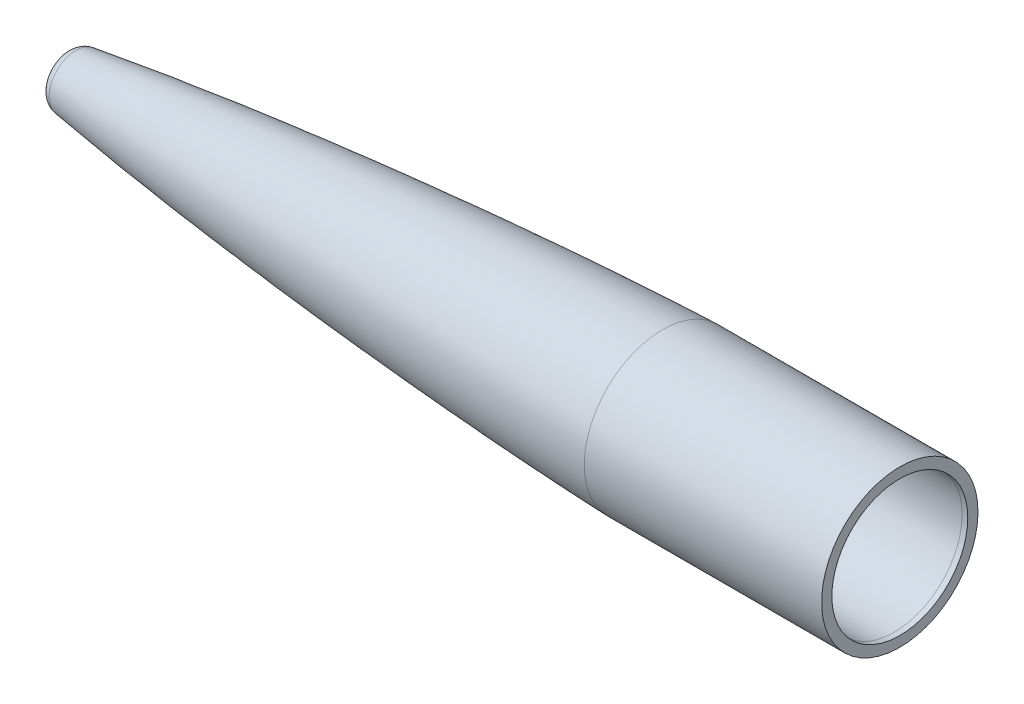
ISO-10303-21;
HEADER;
FILE_DESCRIPTION(('STEP AP214'),'2;1');
FILE_NAME('part.step','',(''),(''),'','','');
FILE_SCHEMA(('AUTOMOTIVE_DESIGN { 1 0 10303 214 1 1 1 1 }'));
ENDSEC;
DATA;
#1=APPLICATION_CONTEXT('core data for automotive mechanical design processes');
#2=APPLICATION_PROTOCOL_DEFINITION('international standard','automotive_design',2000,#1);
#3=PRODUCT_CONTEXT('',#1,'mechanical');
#4=PRODUCT('Part','Part','',(#3));
#5=PRODUCT_RELATED_PRODUCT_CATEGORY('part','',(#4));
#6=PRODUCT_DEFINITION_FORMATION('','',#4);
#7=PRODUCT_DEFINITION_CONTEXT('part definition',#1,'design');
#8=PRODUCT_DEFINITION('design','',#6,#7);
#9=PRODUCT_DEFINITION_SHAPE('','',#8);
#10=(LENGTH_UNIT() NAMED_UNIT(*) SI_UNIT(.MILLI.,.METRE.));
#11=(NAMED_UNIT(*) PLANE_ANGLE_UNIT() SI_UNIT($,.RADIAN.));
#12=(NAMED_UNIT(*) SI_UNIT($,.STERADIAN.) SOLID_ANGLE_UNIT());
#13=UNCERTAINTY_MEASURE_WITH_UNIT(LENGTH_MEASURE(1.E-05),#10,'distance_accuracy_value','');
#14=(GEOMETRIC_REPRESENTATION_CONTEXT(3) GLOBAL_UNCERTAINTY_ASSIGNED_CONTEXT((#13)) GLOBAL_UNIT_ASSIGNED_CONTEXT((#10,
#11,#12)) REPRESENTATION_CONTEXT('',''));
#15=CARTESIAN_POINT('',(0.,0.,0.));
#16=DIRECTION('',(0.,0.,1.));
#17=DIRECTION('',(1.,0.,0.));
#18=AXIS2_PLACEMENT_3D('',#15,#16,#17);
#19=CARTESIAN_POINT('',(0.,-76.2,0.));
#20=DIRECTION('',(1.,0.,0.));
#21=DIRECTION('',(0.,0.,-1.));
#22=AXIS2_PLACEMENT_3D('',#19,#20,#21);
#23=CYLINDRICAL_SURFACE('',#22,87.6605702842971);
#24=CARTESIAN_POINT('',(6.35000000000027,-76.2,0.));
#25=DIRECTION('',(1.,0.,0.));
#26=DIRECTION('',(0.,0.,-1.));
#27=AXIS2_PLACEMENT_3D('',#24,#25,#26);
#28=CIRCLE('',#27,87.6605702842971);
#29=CARTESIAN_POINT('',(6.35000000000027,-76.2,-87.6605702842971));
#30=VERTEX_POINT('',#29);
#31=EDGE_CURVE('E68',#30,#30,#28,.T.);
#32=ORIENTED_EDGE('',*,*,#31,.F.);
#33=EDGE_LOOP('',(#32));
#34=FACE_BOUND('',#33,.T.);
#35=CARTESIAN_POINT('',(-259.812483714893,-76.2,0.));
#36=DIRECTION('',(1.,0.,0.));
#37=DIRECTION('',(0.,0.,-1.));
#38=AXIS2_PLACEMENT_3D('',#35,#36,#37);
#39=CIRCLE('',#38,87.6605702842971);
#40=CARTESIAN_POINT('',(-259.812483714893,-76.2,-87.6605702842971));
#41=VERTEX_POINT('',#40);
#42=EDGE_CURVE('E10',#41,#41,#39,.T.);
#43=ORIENTED_EDGE('',*,*,#42,.T.);
#44=EDGE_LOOP('',(#43));
#45=FACE_BOUND('',#44,.T.);
#46=ADVANCED_FACE('F31',(#34,#45),#23,.T.);
#47=CARTESIAN_POINT('',(-259.812483714893,11.460570284297,0.));
#48=CARTESIAN_POINT('',(-287.312106379697,10.5623408515305,0.));
#49=CARTESIAN_POINT('',(-342.298022137353,8.17156900853598,0.));
#50=CARTESIAN_POINT('',(-452.140135715747,1.83352473554385,0.));
#51=CARTESIAN_POINT('',(-589.280273051557,-8.5121188078909,0.));
#52=CARTESIAN_POINT('',(-726.176632388446,-21.7709007537404,0.));
#53=CARTESIAN_POINT('',(-835.465785428388,-34.5887261399924,0.));
#54=CARTESIAN_POINT('',(-890.027026606975,-41.9652027624198,0.));
#55=CARTESIAN_POINT('',(-917.245364412614,-46.0396236215406,0.));
#56=B_SPLINE_CURVE_WITH_KNOTS('',3,(#47,#48,#49,#50,#51,#52,#53,#54,#55),.UNSPECIFIED.,.F.,.F.,
(4,1,1,1,1,1,4),(0.121539177885851,0.200323508121493,0.279107838357135,0.436676498828419,
0.594245159299703,0.673029489535345,0.751813819770986),.UNSPECIFIED.);
#57=CARTESIAN_POINT('',(0.,-76.2,0.));
#58=DIRECTION('',(1.,0.,0.));
#59=AXIS1_PLACEMENT('',#57,#58);
#60=SURFACE_OF_REVOLUTION('',#56,#59);
#61=CARTESIAN_POINT('',(-917.245364412614,-76.2,0.));
#62=DIRECTION('',(1.,0.,0.));
#63=DIRECTION('',(0.,0.,-1.));
#64=AXIS2_PLACEMENT_3D('',#61,#62,#63);
#65=CIRCLE('',#64,30.1603763784594);
#66=CARTESIAN_POINT('',(-917.245364412614,-76.2,-30.1603763784594));
#67=VERTEX_POINT('',#66);
#68=EDGE_CURVE('E37',#67,#67,#65,.T.);
#69=ORIENTED_EDGE('',*,*,#68,.T.);
#70=EDGE_LOOP('',(#69));
#71=FACE_BOUND('',#70,.T.);
#72=ORIENTED_EDGE('',*,*,#42,.F.);
#73=EDGE_LOOP('',(#72));
#74=FACE_BOUND('',#73,.T.);
#75=ADVANCED_FACE('F112',(#71,#74),#60,.F.);
#76=CARTESIAN_POINT('',(-915.3652,-76.2,0.));
#77=DIRECTION('',(1.,0.,0.));
#78=DIRECTION('',(0.,0.,-1.));
#79=AXIS2_PLACEMENT_3D('',#76,#77,#78);
#80=TOROIDAL_SURFACE('',#79,17.6003213713529,12.7);
#81=CARTESIAN_POINT('',(-928.0652,-76.2,0.));
#82=DIRECTION('',(1.,0.,0.));
#83=DIRECTION('',(0.,0.,-1.));
#84=AXIS2_PLACEMENT_3D('',#81,#82,#83);
#85=CIRCLE('',#84,17.6003213713529);
#86=CARTESIAN_POINT('',(-928.0652,-76.2,-17.6003213713529));
#87=VERTEX_POINT('',#86);
#88=EDGE_CURVE('E41',#87,#87,#85,.T.);
#89=ORIENTED_EDGE('',*,*,#88,.T.);
#90=EDGE_LOOP('',(#89));
#91=FACE_BOUND('',#90,.T.);
#92=ORIENTED_EDGE('',*,*,#68,.F.);
#93=EDGE_LOOP('',(#92));
#94=FACE_BOUND('',#93,.T.);
#95=ADVANCED_FACE('F109',(#91,#94),#80,.T.);
#96=CARTESIAN_POINT('',(0.,-76.2,0.));
#97=DIRECTION('',(1.,0.,0.));
#98=DIRECTION('',(0.,0.,-1.));
#99=AXIS2_PLACEMENT_3D('',#96,#97,#98);
#100=CYLINDRICAL_SURFACE('',#99,17.6003213713529);
#101=ORIENTED_EDGE('',*,*,#88,.F.);
#102=EDGE_LOOP('',(#101));
#103=FACE_BOUND('',#102,.T.);
#104=CARTESIAN_POINT('',(-921.7152,-76.2,0.));
#105=DIRECTION('',(1.,0.,0.));
#106=DIRECTION('',(0.,0.,-1.));
#107=AXIS2_PLACEMENT_3D('',#104,#105,#106);
#108=CIRCLE('',#107,17.6003213713529);
#109=CARTESIAN_POINT('',(-921.7152,-76.2,-17.6003213713529));
#110=VERTEX_POINT('',#109);
#111=EDGE_CURVE('E45',#110,#110,#108,.T.);
#112=ORIENTED_EDGE('',*,*,#111,.T.);
#113=EDGE_LOOP('',(#112));
#114=FACE_BOUND('',#113,.T.);
#115=ADVANCED_FACE('F105',(#103,#114),#100,.F.);
#116=CARTESIAN_POINT('',(-915.3652,-76.2,0.));
#117=DIRECTION('',(1.,0.,0.));
#118=DIRECTION('',(0.,0.,-1.));
#119=AXIS2_PLACEMENT_3D('',#116,#117,#118);
#120=TOROIDAL_SURFACE('',#119,17.6003213713529,6.35000000000007);
#121=ORIENTED_EDGE('',*,*,#111,.F.);
#122=EDGE_LOOP('',(#121));
#123=FACE_BOUND('',#122,.T.);
#124=CARTESIAN_POINT('',(-916.305282206307,-76.2,0.));
#125=DIRECTION('',(1.,0.,0.));
#126=DIRECTION('',(0.,0.,-1.));
#127=AXIS2_PLACEMENT_3D('',#124,#125,#126);
#128=CIRCLE('',#127,23.8803488749062);
#129=CARTESIAN_POINT('',(-916.305282206307,-76.2,-23.8803488749062));
#130=VERTEX_POINT('',#129);
#131=EDGE_CURVE('E50',#130,#130,#128,.T.);
#132=ORIENTED_EDGE('',*,*,#131,.T.);
#133=EDGE_LOOP('',(#132));
#134=FACE_BOUND('',#133,.T.);
#135=ADVANCED_FACE('F101',(#123,#134),#120,.F.);
#136=CARTESIAN_POINT('',(-259.605182082093,5.11395496327444,0.));
#137=CARTESIAN_POINT('',(-267.12768254606,4.86824499819252,0.));
#138=CARTESIAN_POINT('',(-283.426031509972,4.28566928092725,0.));
#139=CARTESIAN_POINT('',(-317.270262328934,2.88050564552106,0.));
#140=CARTESIAN_POINT('',(-361.130016616179,0.711244662128463,0.));
#141=CARTESIAN_POINT('',(-431.275457268552,-3.37195649395594,0.));
#142=CARTESIAN_POINT('',(-501.372917975129,-8.26687627302136,0.));
#143=CARTESIAN_POINT('',(-571.414486842692,-13.8916826479783,0.));
#144=CARTESIAN_POINT('',(-623.914744737059,-18.4776988889442,0.));
#145=CARTESIAN_POINT('',(-676.380314026956,-23.4393497952148,0.));
#146=CARTESIAN_POINT('',(-728.805663240347,-28.7990620723279,0.));
#147=CARTESIAN_POINT('',(-772.453634614019,-33.627485173269,0.));
#148=CARTESIAN_POINT('',(-807.341816529924,-37.7391545432386,0.));
#149=CARTESIAN_POINT('',(-833.490683910714,-40.9589001471484,0.));
#150=CARTESIAN_POINT('',(-859.619375691871,-44.3289411148186,0.));
#151=CARTESIAN_POINT('',(-885.723877264818,-47.8693351323976,0.));
#152=CARTESIAN_POINT('',(-904.61249297492,-50.577906922154,0.));
#153=CARTESIAN_POINT('',(-914.800968172167,-52.0944643953555,0.));
#154=CARTESIAN_POINT('',(-916.305282206307,-52.3196511250938,0.));
#155=B_SPLINE_CURVE_WITH_KNOTS('',3,(#136,#137,#138,#139,#140,#141,#142,#143,#144,#145,#146,
#147,#148,#149,#150,#151,#152,#153,#154),.UNSPECIFIED.,.F.,.F.,(4,1,1,1,1,1,1,1,1,1,1,1,1,1,1,1,
4),(0.121539177885851,0.143122913317239,0.168303261053087,0.218663956524784,0.26902465199648,
0.369746042939873,0.420106738411569,0.470467433883266,0.520828129354962,0.571188824826659,
0.621549520298355,0.646729868034203,0.671910215770052,0.6970905635059,0.722270911241748,
0.747451258977596,0.751813819770986),.UNSPECIFIED.);
#156=CARTESIAN_POINT('',(0.,-76.2,0.));
#157=DIRECTION('',(1.,0.,0.));
#158=AXIS1_PLACEMENT('',#156,#157);
#159=SURFACE_OF_REVOLUTION('',#155,#158);
#160=ORIENTED_EDGE('',*,*,#131,.F.);
#161=EDGE_LOOP('',(#160));
#162=FACE_BOUND('',#161,.T.);
#163=CARTESIAN_POINT('',(-259.605182082093,-76.2,0.));
#164=DIRECTION('',(1.,0.,0.));
#165=DIRECTION('',(0.,0.,-1.));
#166=AXIS2_PLACEMENT_3D('',#163,#164,#165);
#167=CIRCLE('',#166,81.3139549632744);
#168=CARTESIAN_POINT('',(-259.605182082093,-76.2,-81.3139549632744));
#169=VERTEX_POINT('',#168);
#170=EDGE_CURVE('E53',#169,#169,#167,.T.);
#171=ORIENTED_EDGE('',*,*,#170,.T.);
#172=EDGE_LOOP('',(#171));
#173=FACE_BOUND('',#172,.T.);
#174=ADVANCED_FACE('F97',(#162,#173),#159,.T.);
#175=CARTESIAN_POINT('',(-259.397880449279,-76.2,0.));
#176=DIRECTION('',(1.,0.,0.));
#177=DIRECTION('',(0.,0.,-1.));
#178=AXIS2_PLACEMENT_3D('',#175,#176,#177);
#179=TOROIDAL_SURFACE('',#178,74.9673396422523,6.35000000000002);
#180=ORIENTED_EDGE('',*,*,#170,.F.);
#181=EDGE_LOOP('',(#180));
#182=FACE_BOUND('',#181,.T.);
#183=CARTESIAN_POINT('',(-254.,-76.2,0.));
#184=DIRECTION('',(1.,0.,0.));
#185=DIRECTION('',(0.,0.,-1.));
#186=AXIS2_PLACEMENT_3D('',#183,#184,#185);
#187=CIRCLE('',#186,78.3117957497969);
#188=CARTESIAN_POINT('',(-254.,-76.2,-78.3117957497969));
#189=VERTEX_POINT('',#188);
#190=EDGE_CURVE('E56',#189,#189,#187,.T.);
#191=ORIENTED_EDGE('',*,*,#190,.T.);
#192=EDGE_LOOP('',(#191));
#193=FACE_BOUND('',#192,.T.);
#194=ADVANCED_FACE('F93',(#182,#193),#179,.F.);
#195=CARTESIAN_POINT('',(-248.602119550721,-76.2,0.));
#196=DIRECTION('',(1.,0.,0.));
#197=DIRECTION('',(0.,0.,-1.));
#198=AXIS2_PLACEMENT_3D('',#195,#196,#197);
#199=TOROIDAL_SURFACE('',#198,81.6562518573414,6.34999999999995);
#200=CARTESIAN_POINT('',(-248.413737761523,-76.2,0.));
#201=DIRECTION('',(1.,0.,0.));
#202=DIRECTION('',(0.,0.,-1.));
#203=AXIS2_PLACEMENT_3D('',#200,#201,#202);
#204=CIRCLE('',#203,75.3090467793958);
#205=CARTESIAN_POINT('',(-248.413737761523,-76.2,-75.3090467793958));
#206=VERTEX_POINT('',#205);
#207=EDGE_CURVE('E59',#206,#206,#204,.T.);
#208=ORIENTED_EDGE('',*,*,#207,.T.);
#209=EDGE_LOOP('',(#208));
#210=FACE_BOUND('',#209,.T.);
#211=ORIENTED_EDGE('',*,*,#190,.F.);
#212=EDGE_LOOP('',(#211));
#213=FACE_BOUND('',#212,.T.);
#214=ADVANCED_FACE('F88',(#210,#213),#199,.T.);
#215=CARTESIAN_POINT('',(0.,0.,0.));
#216=CARTESIAN_POINT('',(-50.8,0.,0.));
#217=CARTESIAN_POINT('',(-101.6,0.,0.));
#218=CARTESIAN_POINT('',(-157.18237532759,0.,0.));
#219=CARTESIAN_POINT('',(-166.74712598277,0.,0.));
#220=CARTESIAN_POINT('',(-181.09425196554,0.,0.));
#221=CARTESIAN_POINT('',(-190.65900262072,0.,0.));
#222=CARTESIAN_POINT('',(-199.585120864969,0.,0.));
#223=CARTESIAN_POINT('',(-207.872606698287,0.,0.));
#224=CARTESIAN_POINT('',(-220.304800851467,-0.15495983877073,0.));
#225=CARTESIAN_POINT('',(-228.589711976257,-0.361524820706449,0.));
#226=CARTESIAN_POINT('',(-235.094659098791,-0.523710541786571,0.));
#227=CARTESIAN_POINT('',(-239.819642219067,-0.641517002011094,0.));
#228=CARTESIAN_POINT('',(-245.046645358789,-0.791480258471811,0.));
#229=CARTESIAN_POINT('',(-247.911294959409,-0.876040976098197,0.));
#230=CARTESIAN_POINT('',(-248.413737761523,-0.890953220604229,0.));
#231=B_SPLINE_CURVE_WITH_KNOTS('',3,(#215,#216,#217,#218,#219,#220,#221,#222,#223,#224,#225,
#226,#227,#228,#229,#230),.UNSPECIFIED.,.F.,.F.,(4,2,1,1,2,1,1,2,1,1,4),(0.761574076780111,
0.907841521459126,0.921611321039098,0.93538112061907,0.949150920199042,0.961081917990901,
0.97301291578276,0.98494391357462,0.991748303184292,0.998552692793965,1.),.UNSPECIFIED.);
#232=CARTESIAN_POINT('',(0.,-76.2,0.));
#233=DIRECTION('',(1.,0.,0.));
#234=AXIS1_PLACEMENT('',#232,#233);
#235=SURFACE_OF_REVOLUTION('',#231,#234);
#236=ORIENTED_EDGE('',*,*,#207,.F.);
#237=EDGE_LOOP('',(#236));
#238=FACE_BOUND('',#237,.T.);
#239=CARTESIAN_POINT('',(0.,-76.2,0.));
#240=DIRECTION('',(1.,0.,0.));
#241=DIRECTION('',(0.,0.,-1.));
#242=AXIS2_PLACEMENT_3D('',#239,#240,#241);
#243=CIRCLE('',#242,76.2);
#244=CARTESIAN_POINT('',(0.,-76.2,-76.2));
#245=VERTEX_POINT('',#244);
#246=EDGE_CURVE('E62',#245,#245,#243,.T.);
#247=ORIENTED_EDGE('',*,*,#246,.T.);
#248=EDGE_LOOP('',(#247));
#249=FACE_BOUND('',#248,.T.);
#250=ADVANCED_FACE('F83',(#238,#249),#235,.T.);
#251=CARTESIAN_POINT('',(0.,-76.2,0.));
#252=DIRECTION('',(1.,0.,0.));
#253=DIRECTION('',(0.,0.,-1.));
#254=AXIS2_PLACEMENT_3D('',#251,#252,#253);
#255=CYLINDRICAL_SURFACE('',#254,76.2);
#256=CARTESIAN_POINT('',(6.34999999999949,-76.2,0.));
#257=DIRECTION('',(1.,0.,0.));
#258=DIRECTION('',(0.,0.,-1.));
#259=AXIS2_PLACEMENT_3D('',#256,#257,#258);
#260=CIRCLE('',#259,76.2);
#261=CARTESIAN_POINT('',(6.34999999999949,-76.2,-76.2));
#262=VERTEX_POINT('',#261);
#263=EDGE_CURVE('E65',#262,#262,#260,.T.);
#264=ORIENTED_EDGE('',*,*,#263,.T.);
#265=EDGE_LOOP('',(#264));
#266=FACE_BOUND('',#265,.T.);
#267=ORIENTED_EDGE('',*,*,#246,.F.);
#268=EDGE_LOOP('',(#267));
#269=FACE_BOUND('',#268,.T.);
#270=ADVANCED_FACE('F87',(#266,#269),#255,.F.);
#271=CARTESIAN_POINT('',(6.34999999999988,-7.78023478975536E-13,0.));
#272=DIRECTION('',(-1.,0.,0.));
#273=DIRECTION('',(0.,0.,1.));
#274=AXIS2_PLACEMENT_3D('',#271,#272,#273);
#275=PLANE('',#274);
#276=ORIENTED_EDGE('',*,*,#263,.F.);
#277=EDGE_LOOP('',(#276));
#278=FACE_BOUND('',#277,.T.);
#279=ORIENTED_EDGE('',*,*,#31,.T.);
#280=EDGE_LOOP('',(#279));
#281=FACE_BOUND('',#280,.T.);
#282=ADVANCED_FACE('F130',(#278,#281),#275,.F.);
#283=CLOSED_SHELL('',(#46,#75,#95,#115,#135,#174,#194,#214,#250,#270,#282));
#284=MANIFOLD_SOLID_BREP('B2',#283);
#285=ADVANCED_BREP_SHAPE_REPRESENTATION('',(#18,#284),#14);
#286=SHAPE_DEFINITION_REPRESENTATION(#9,#285);
ENDSEC;
END-ISO-10303-21;
